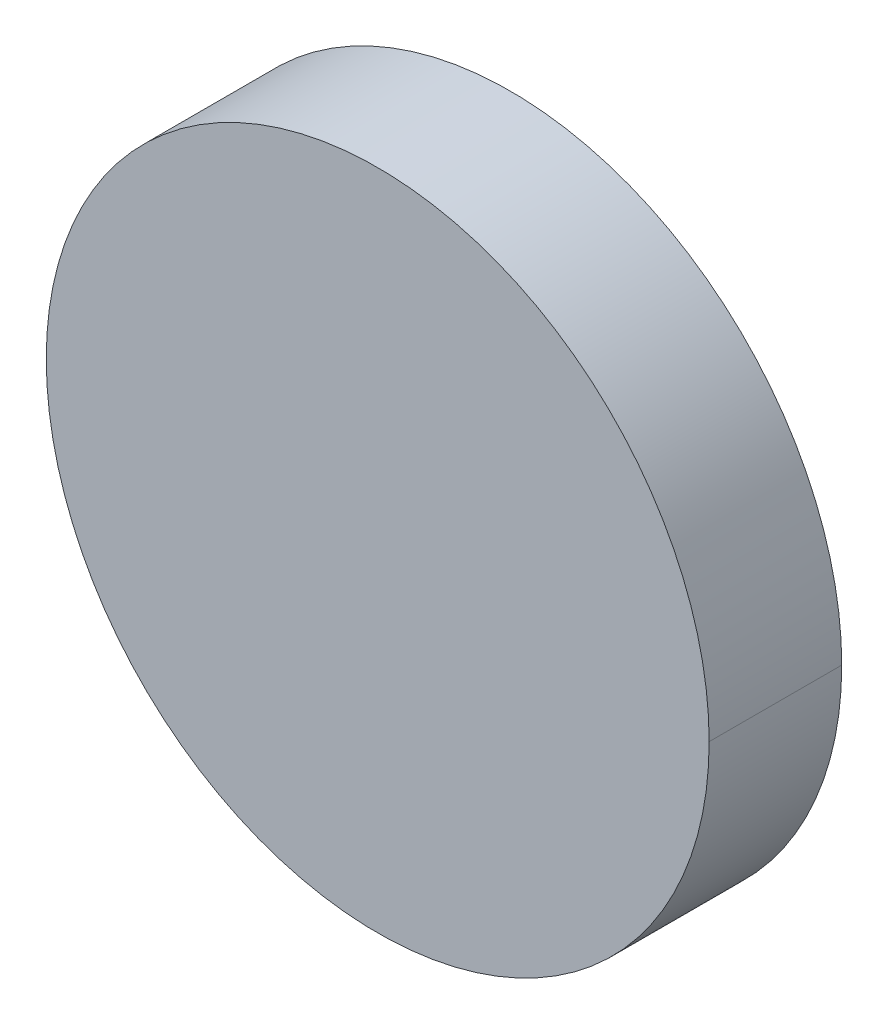
ISO-10303-21;
HEADER;
FILE_DESCRIPTION(('STEP AP214'),'2;1');
FILE_NAME('part.step','',(''),(''),'','','');
FILE_SCHEMA(('AUTOMOTIVE_DESIGN { 1 0 10303 214 1 1 1 1 }'));
ENDSEC;
DATA;
#1=APPLICATION_CONTEXT('core data for automotive mechanical design processes');
#2=APPLICATION_PROTOCOL_DEFINITION('international standard','automotive_design',2000,#1);
#3=PRODUCT_CONTEXT('',#1,'mechanical');
#4=PRODUCT('Part','Part','',(#3));
#5=PRODUCT_RELATED_PRODUCT_CATEGORY('part','',(#4));
#6=PRODUCT_DEFINITION_FORMATION('','',#4);
#7=PRODUCT_DEFINITION_CONTEXT('part definition',#1,'design');
#8=PRODUCT_DEFINITION('design','',#6,#7);
#9=PRODUCT_DEFINITION_SHAPE('','',#8);
#10=(LENGTH_UNIT() NAMED_UNIT(*) SI_UNIT(.MILLI.,.METRE.));
#11=(NAMED_UNIT(*) PLANE_ANGLE_UNIT() SI_UNIT($,.RADIAN.));
#12=(NAMED_UNIT(*) SI_UNIT($,.STERADIAN.) SOLID_ANGLE_UNIT());
#13=UNCERTAINTY_MEASURE_WITH_UNIT(LENGTH_MEASURE(1.E-05),#10,'distance_accuracy_value','');
#14=(GEOMETRIC_REPRESENTATION_CONTEXT(3) GLOBAL_UNCERTAINTY_ASSIGNED_CONTEXT((#13)) GLOBAL_UNIT_ASSIGNED_CONTEXT((#10,
#11,#12)) REPRESENTATION_CONTEXT('',''));
#15=CARTESIAN_POINT('',(0.,0.,0.));
#16=DIRECTION('',(0.,0.,1.));
#17=DIRECTION('',(1.,0.,0.));
#18=AXIS2_PLACEMENT_3D('',#15,#16,#17);
#19=CARTESIAN_POINT('',(-0.248,0.248,0.24));
#20=DIRECTION('',(0.,0.,1.));
#21=DIRECTION('',(1.,0.,0.));
#22=AXIS2_PLACEMENT_3D('',#19,#20,#21);
#23=CYLINDRICAL_SURFACE('',#22,0.025);
#24=CARTESIAN_POINT('',(-0.248,0.248,0.24));
#25=DIRECTION('',(0.,0.,1.));
#26=DIRECTION('',(1.,0.,0.));
#27=AXIS2_PLACEMENT_3D('',#24,#25,#26);
#28=CIRCLE('',#27,0.025);
#29=CARTESIAN_POINT('',(-0.223,0.248,0.24));
#30=VERTEX_POINT('',#29);
#31=CARTESIAN_POINT('',(-0.273,0.248,0.24));
#32=VERTEX_POINT('',#31);
#33=EDGE_CURVE('E11',#30,#32,#28,.T.);
#34=ORIENTED_EDGE('',*,*,#33,.T.);
#35=DIRECTION('',(0.,0.,1.));
#36=VECTOR('',#35,1.);
#37=CARTESIAN_POINT('',(-0.273,0.248,0.24));
#38=LINE('',#37,#36);
#39=CARTESIAN_POINT('',(-0.273,0.248,0.25));
#40=VERTEX_POINT('',#39);
#41=EDGE_CURVE('E24',#32,#40,#38,.T.);
#42=ORIENTED_EDGE('',*,*,#41,.T.);
#43=CARTESIAN_POINT('',(-0.248,0.248,0.25));
#44=DIRECTION('',(0.,0.,1.));
#45=DIRECTION('',(1.,0.,0.));
#46=AXIS2_PLACEMENT_3D('',#43,#44,#45);
#47=CIRCLE('',#46,0.025);
#48=CARTESIAN_POINT('',(-0.223,0.248,0.25));
#49=VERTEX_POINT('',#48);
#50=EDGE_CURVE('E39',#49,#40,#47,.T.);
#51=ORIENTED_EDGE('',*,*,#50,.F.);
#52=DIRECTION('',(0.,0.,1.));
#53=VECTOR('',#52,1.);
#54=CARTESIAN_POINT('',(-0.223,0.248,0.24));
#55=LINE('',#54,#53);
#56=EDGE_CURVE('E41',#30,#49,#55,.T.);
#57=ORIENTED_EDGE('',*,*,#56,.F.);
#58=EDGE_LOOP('',(#34,#42,#51,#57));
#59=FACE_BOUND('',#58,.T.);
#60=ADVANCED_FACE('F17',(#59),#23,.T.);
#61=CARTESIAN_POINT('',(-0.248,0.248,0.24));
#62=DIRECTION('',(0.,0.,1.));
#63=DIRECTION('',(1.,0.,0.));
#64=AXIS2_PLACEMENT_3D('',#61,#62,#63);
#65=CYLINDRICAL_SURFACE('',#64,0.025);
#66=ORIENTED_EDGE('',*,*,#41,.F.);
#67=CARTESIAN_POINT('',(-0.248,0.248,0.24));
#68=DIRECTION('',(0.,0.,1.));
#69=DIRECTION('',(1.,0.,0.));
#70=AXIS2_PLACEMENT_3D('',#67,#68,#69);
#71=CIRCLE('',#70,0.025);
#72=EDGE_CURVE('E50',#32,#30,#71,.T.);
#73=ORIENTED_EDGE('',*,*,#72,.T.);
#74=ORIENTED_EDGE('',*,*,#56,.T.);
#75=CARTESIAN_POINT('',(-0.248,0.248,0.25));
#76=DIRECTION('',(0.,0.,1.));
#77=DIRECTION('',(1.,0.,0.));
#78=AXIS2_PLACEMENT_3D('',#75,#76,#77);
#79=CIRCLE('',#78,0.025);
#80=EDGE_CURVE('E49',#40,#49,#79,.T.);
#81=ORIENTED_EDGE('',*,*,#80,.F.);
#82=EDGE_LOOP('',(#66,#73,#74,#81));
#83=FACE_BOUND('',#82,.T.);
#84=ADVANCED_FACE('F48',(#83),#65,.T.);
#85=CARTESIAN_POINT('',(-0.248,0.248,0.24));
#86=DIRECTION('',(0.,0.,1.));
#87=DIRECTION('',(1.,0.,0.));
#88=AXIS2_PLACEMENT_3D('',#85,#86,#87);
#89=PLANE('',#88);
#90=ORIENTED_EDGE('',*,*,#33,.F.);
#91=ORIENTED_EDGE('',*,*,#72,.F.);
#92=EDGE_LOOP('',(#90,#91));
#93=FACE_BOUND('',#92,.T.);
#94=ADVANCED_FACE('F56',(#93),#89,.F.);
#95=CARTESIAN_POINT('',(-0.248,0.248,0.25));
#96=DIRECTION('',(0.,0.,1.));
#97=DIRECTION('',(1.,0.,0.));
#98=AXIS2_PLACEMENT_3D('',#95,#96,#97);
#99=PLANE('',#98);
#100=ORIENTED_EDGE('',*,*,#50,.T.);
#101=ORIENTED_EDGE('',*,*,#80,.T.);
#102=EDGE_LOOP('',(#100,#101));
#103=FACE_BOUND('',#102,.T.);
#104=ADVANCED_FACE('F52',(#103),#99,.T.);
#105=CLOSED_SHELL('',(#60,#84,#94,#104));
#106=MANIFOLD_SOLID_BREP('B1',#105);
#107=ADVANCED_BREP_SHAPE_REPRESENTATION('',(#18,#106),#14);
#108=SHAPE_DEFINITION_REPRESENTATION(#9,#107);
ENDSEC;
END-ISO-10303-21;
